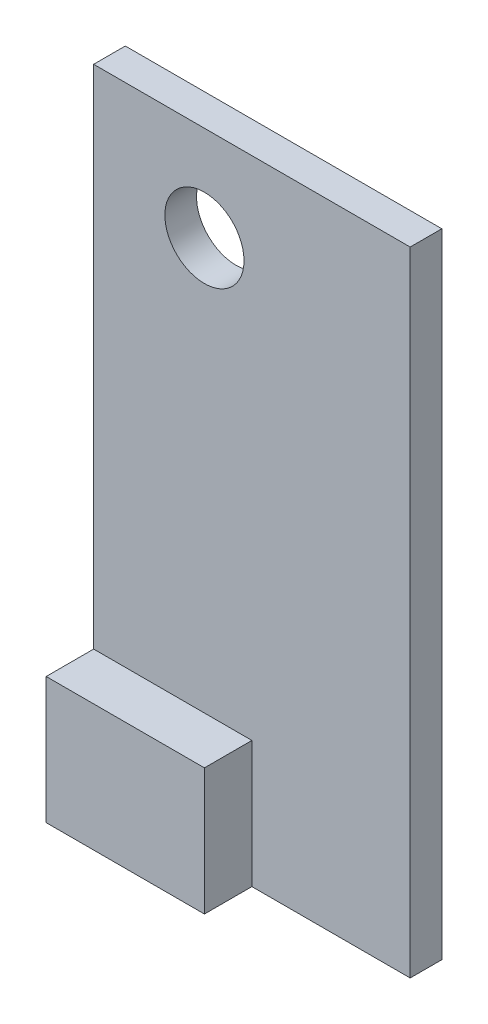
ISO-10303-21;
HEADER;
FILE_DESCRIPTION(('STEP AP214'),'2;1');
FILE_NAME('part.step','',(''),(''),'','','');
FILE_SCHEMA(('AUTOMOTIVE_DESIGN { 1 0 10303 214 1 1 1 1 }'));
ENDSEC;
DATA;
#1=APPLICATION_CONTEXT('core data for automotive mechanical design processes');
#2=APPLICATION_PROTOCOL_DEFINITION('international standard','automotive_design',2000,#1);
#3=PRODUCT_CONTEXT('',#1,'mechanical');
#4=PRODUCT('Part','Part','',(#3));
#5=PRODUCT_RELATED_PRODUCT_CATEGORY('part','',(#4));
#6=PRODUCT_DEFINITION_FORMATION('','',#4);
#7=PRODUCT_DEFINITION_CONTEXT('part definition',#1,'design');
#8=PRODUCT_DEFINITION('design','',#6,#7);
#9=PRODUCT_DEFINITION_SHAPE('','',#8);
#10=(LENGTH_UNIT() NAMED_UNIT(*) SI_UNIT(.MILLI.,.METRE.));
#11=(NAMED_UNIT(*) PLANE_ANGLE_UNIT() SI_UNIT($,.RADIAN.));
#12=(NAMED_UNIT(*) SI_UNIT($,.STERADIAN.) SOLID_ANGLE_UNIT());
#13=UNCERTAINTY_MEASURE_WITH_UNIT(LENGTH_MEASURE(1.E-05),#10,'distance_accuracy_value','');
#14=(GEOMETRIC_REPRESENTATION_CONTEXT(3) GLOBAL_UNCERTAINTY_ASSIGNED_CONTEXT((#13)) GLOBAL_UNIT_ASSIGNED_CONTEXT((#10,
#11,#12)) REPRESENTATION_CONTEXT('',''));
#15=CARTESIAN_POINT('',(0.,0.,0.));
#16=DIRECTION('',(0.,0.,1.));
#17=DIRECTION('',(1.,0.,0.));
#18=AXIS2_PLACEMENT_3D('',#15,#16,#17);
#19=CARTESIAN_POINT('',(0.,0.,10.));
#20=DIRECTION('',(0.,0.,1.));
#21=DIRECTION('',(1.,0.,0.));
#22=AXIS2_PLACEMENT_3D('',#19,#20,#21);
#23=PLANE('',#22);
#24=CARTESIAN_POINT('',(35.,170.,10.));
#25=DIRECTION('',(0.,0.,1.));
#26=DIRECTION('',(1.,0.,0.));
#27=AXIS2_PLACEMENT_3D('',#24,#25,#26);
#28=CIRCLE('',#27,12.5);
#29=CARTESIAN_POINT('',(47.5,170.,10.));
#30=VERTEX_POINT('',#29);
#31=EDGE_CURVE('E120',#30,#30,#28,.T.);
#32=ORIENTED_EDGE('',*,*,#31,.F.);
#33=EDGE_LOOP('',(#32));
#34=FACE_BOUND('',#33,.T.);
#35=DIRECTION('',(0.,-1.,0.));
#36=VECTOR('',#35,1.);
#37=CARTESIAN_POINT('',(0.,200.,10.));
#38=LINE('',#37,#36);
#39=CARTESIAN_POINT('',(0.,200.,10.));
#40=VERTEX_POINT('',#39);
#41=CARTESIAN_POINT('',(0.,40.,10.));
#42=VERTEX_POINT('',#41);
#43=EDGE_CURVE('E134',#40,#42,#38,.T.);
#44=ORIENTED_EDGE('',*,*,#43,.T.);
#45=DIRECTION('',(1.,0.,0.));
#46=VECTOR('',#45,1.);
#47=CARTESIAN_POINT('',(0.,40.,10.));
#48=LINE('',#47,#46);
#49=CARTESIAN_POINT('',(50.,40.,10.));
#50=VERTEX_POINT('',#49);
#51=EDGE_CURVE('E124',#42,#50,#48,.T.);
#52=ORIENTED_EDGE('',*,*,#51,.T.);
#53=DIRECTION('',(0.,-1.,0.));
#54=VECTOR('',#53,1.);
#55=CARTESIAN_POINT('',(50.,0.,10.));
#56=LINE('',#55,#54);
#57=CARTESIAN_POINT('',(50.,0.,10.));
#58=VERTEX_POINT('',#57);
#59=EDGE_CURVE('E125',#50,#58,#56,.T.);
#60=ORIENTED_EDGE('',*,*,#59,.T.);
#61=DIRECTION('',(1.,0.,0.));
#62=VECTOR('',#61,1.);
#63=CARTESIAN_POINT('',(0.,0.,10.));
#64=LINE('',#63,#62);
#65=CARTESIAN_POINT('',(100.,0.,10.));
#66=VERTEX_POINT('',#65);
#67=EDGE_CURVE('E83',#58,#66,#64,.T.);
#68=ORIENTED_EDGE('',*,*,#67,.T.);
#69=DIRECTION('',(0.,1.,0.));
#70=VECTOR('',#69,1.);
#71=CARTESIAN_POINT('',(100.,0.,10.));
#72=LINE('',#71,#70);
#73=CARTESIAN_POINT('',(100.,200.,10.));
#74=VERTEX_POINT('',#73);
#75=EDGE_CURVE('E137',#66,#74,#72,.T.);
#76=ORIENTED_EDGE('',*,*,#75,.T.);
#77=DIRECTION('',(-1.,0.,0.));
#78=VECTOR('',#77,1.);
#79=CARTESIAN_POINT('',(100.,200.,10.));
#80=LINE('',#79,#78);
#81=EDGE_CURVE('E59',#74,#40,#80,.T.);
#82=ORIENTED_EDGE('',*,*,#81,.T.);
#83=EDGE_LOOP('',(#44,#52,#60,#68,#76,#82));
#84=FACE_BOUND('',#83,.T.);
#85=ADVANCED_FACE('F35',(#34,#84),#23,.T.);
#86=CARTESIAN_POINT('',(0.,200.,10.));
#87=DIRECTION('',(1.,0.,0.));
#88=DIRECTION('',(0.,0.,-1.));
#89=AXIS2_PLACEMENT_3D('',#86,#87,#88);
#90=PLANE('',#89);
#91=DIRECTION('',(0.,0.,-1.));
#92=VECTOR('',#91,1.);
#93=CARTESIAN_POINT('',(0.,0.,10.));
#94=LINE('',#93,#92);
#95=CARTESIAN_POINT('',(0.,0.,25.));
#96=VERTEX_POINT('',#95);
#97=CARTESIAN_POINT('',(0.,0.,0.));
#98=VERTEX_POINT('',#97);
#99=EDGE_CURVE('E11',#96,#98,#94,.T.);
#100=ORIENTED_EDGE('',*,*,#99,.F.);
#101=DIRECTION('',(0.,-1.,0.));
#102=VECTOR('',#101,1.);
#103=CARTESIAN_POINT('',(0.,40.,25.));
#104=LINE('',#103,#102);
#105=CARTESIAN_POINT('',(0.,40.,25.));
#106=VERTEX_POINT('',#105);
#107=EDGE_CURVE('E104',#106,#96,#104,.T.);
#108=ORIENTED_EDGE('',*,*,#107,.F.);
#109=DIRECTION('',(0.,0.,-1.));
#110=VECTOR('',#109,1.);
#111=CARTESIAN_POINT('',(0.,40.,25.));
#112=LINE('',#111,#110);
#113=EDGE_CURVE('E108',#106,#42,#112,.T.);
#114=ORIENTED_EDGE('',*,*,#113,.T.);
#115=ORIENTED_EDGE('',*,*,#43,.F.);
#116=DIRECTION('',(0.,0.,-1.));
#117=VECTOR('',#116,1.);
#118=CARTESIAN_POINT('',(0.,200.,10.));
#119=LINE('',#118,#117);
#120=CARTESIAN_POINT('',(0.,200.,0.));
#121=VERTEX_POINT('',#120);
#122=EDGE_CURVE('E140',#40,#121,#119,.T.);
#123=ORIENTED_EDGE('',*,*,#122,.T.);
#124=DIRECTION('',(0.,-1.,0.));
#125=VECTOR('',#124,1.);
#126=CARTESIAN_POINT('',(0.,200.,0.));
#127=LINE('',#126,#125);
#128=EDGE_CURVE('E133',#121,#98,#127,.T.);
#129=ORIENTED_EDGE('',*,*,#128,.T.);
#130=EDGE_LOOP('',(#100,#108,#114,#115,#123,#129));
#131=FACE_BOUND('',#130,.T.);
#132=ADVANCED_FACE('F37',(#131),#90,.F.);
#133=CARTESIAN_POINT('',(0.,0.,10.));
#134=DIRECTION('',(0.,1.,0.));
#135=DIRECTION('',(0.,0.,1.));
#136=AXIS2_PLACEMENT_3D('',#133,#134,#135);
#137=PLANE('',#136);
#138=DIRECTION('',(1.,0.,0.));
#139=VECTOR('',#138,1.);
#140=CARTESIAN_POINT('',(0.,0.,0.));
#141=LINE('',#140,#139);
#142=CARTESIAN_POINT('',(100.,0.,0.));
#143=VERTEX_POINT('',#142);
#144=EDGE_CURVE('E142',#98,#143,#141,.T.);
#145=ORIENTED_EDGE('',*,*,#144,.T.);
#146=DIRECTION('',(0.,0.,-1.));
#147=VECTOR('',#146,1.);
#148=CARTESIAN_POINT('',(100.,0.,10.));
#149=LINE('',#148,#147);
#150=EDGE_CURVE('E43',#66,#143,#149,.T.);
#151=ORIENTED_EDGE('',*,*,#150,.F.);
#152=ORIENTED_EDGE('',*,*,#67,.F.);
#153=DIRECTION('',(0.,0.,-1.));
#154=VECTOR('',#153,1.);
#155=CARTESIAN_POINT('',(50.,0.,25.));
#156=LINE('',#155,#154);
#157=CARTESIAN_POINT('',(50.,0.,25.));
#158=VERTEX_POINT('',#157);
#159=EDGE_CURVE('E50',#158,#58,#156,.T.);
#160=ORIENTED_EDGE('',*,*,#159,.F.);
#161=DIRECTION('',(1.,0.,0.));
#162=VECTOR('',#161,1.);
#163=CARTESIAN_POINT('',(0.,0.,25.));
#164=LINE('',#163,#162);
#165=EDGE_CURVE('E111',#96,#158,#164,.T.);
#166=ORIENTED_EDGE('',*,*,#165,.F.);
#167=ORIENTED_EDGE('',*,*,#99,.T.);
#168=EDGE_LOOP('',(#145,#151,#152,#160,#166,#167));
#169=FACE_BOUND('',#168,.T.);
#170=ADVANCED_FACE('F169',(#169),#137,.F.);
#171=CARTESIAN_POINT('',(100.,0.,10.));
#172=DIRECTION('',(-1.,0.,0.));
#173=DIRECTION('',(0.,0.,1.));
#174=AXIS2_PLACEMENT_3D('',#171,#172,#173);
#175=PLANE('',#174);
#176=DIRECTION('',(0.,1.,0.));
#177=VECTOR('',#176,1.);
#178=CARTESIAN_POINT('',(100.,0.,0.));
#179=LINE('',#178,#177);
#180=CARTESIAN_POINT('',(100.,200.,0.));
#181=VERTEX_POINT('',#180);
#182=EDGE_CURVE('E144',#143,#181,#179,.T.);
#183=ORIENTED_EDGE('',*,*,#182,.T.);
#184=DIRECTION('',(0.,0.,-1.));
#185=VECTOR('',#184,1.);
#186=CARTESIAN_POINT('',(100.,200.,10.));
#187=LINE('',#186,#185);
#188=EDGE_CURVE('E148',#74,#181,#187,.T.);
#189=ORIENTED_EDGE('',*,*,#188,.F.);
#190=ORIENTED_EDGE('',*,*,#75,.F.);
#191=ORIENTED_EDGE('',*,*,#150,.T.);
#192=EDGE_LOOP('',(#183,#189,#190,#191));
#193=FACE_BOUND('',#192,.T.);
#194=ADVANCED_FACE('F153',(#193),#175,.F.);
#195=CARTESIAN_POINT('',(100.,200.,10.));
#196=DIRECTION('',(0.,-1.,0.));
#197=DIRECTION('',(1.,0.,0.));
#198=AXIS2_PLACEMENT_3D('',#195,#196,#197);
#199=PLANE('',#198);
#200=DIRECTION('',(-1.,0.,0.));
#201=VECTOR('',#200,1.);
#202=CARTESIAN_POINT('',(100.,200.,0.));
#203=LINE('',#202,#201);
#204=EDGE_CURVE('E79',#181,#121,#203,.T.);
#205=ORIENTED_EDGE('',*,*,#204,.T.);
#206=ORIENTED_EDGE('',*,*,#122,.F.);
#207=ORIENTED_EDGE('',*,*,#81,.F.);
#208=ORIENTED_EDGE('',*,*,#188,.T.);
#209=EDGE_LOOP('',(#205,#206,#207,#208));
#210=FACE_BOUND('',#209,.T.);
#211=ADVANCED_FACE('F160',(#210),#199,.F.);
#212=CARTESIAN_POINT('',(0.,0.,0.));
#213=DIRECTION('',(0.,0.,1.));
#214=DIRECTION('',(1.,0.,0.));
#215=AXIS2_PLACEMENT_3D('',#212,#213,#214);
#216=PLANE('',#215);
#217=CARTESIAN_POINT('',(35.,170.,0.));
#218=DIRECTION('',(0.,0.,1.));
#219=DIRECTION('',(1.,0.,0.));
#220=AXIS2_PLACEMENT_3D('',#217,#218,#219);
#221=CIRCLE('',#220,12.5);
#222=CARTESIAN_POINT('',(47.5,170.,0.));
#223=VERTEX_POINT('',#222);
#224=EDGE_CURVE('E195',#223,#223,#221,.T.);
#225=ORIENTED_EDGE('',*,*,#224,.T.);
#226=EDGE_LOOP('',(#225));
#227=FACE_BOUND('',#226,.T.);
#228=ORIENTED_EDGE('',*,*,#144,.F.);
#229=ORIENTED_EDGE('',*,*,#128,.F.);
#230=ORIENTED_EDGE('',*,*,#204,.F.);
#231=ORIENTED_EDGE('',*,*,#182,.F.);
#232=EDGE_LOOP('',(#228,#229,#230,#231));
#233=FACE_BOUND('',#232,.T.);
#234=ADVANCED_FACE('F158',(#227,#233),#216,.F.);
#235=CARTESIAN_POINT('',(50.,40.,25.));
#236=DIRECTION('',(0.,-1.,0.));
#237=DIRECTION('',(0.,0.,-1.));
#238=AXIS2_PLACEMENT_3D('',#235,#236,#237);
#239=PLANE('',#238);
#240=ORIENTED_EDGE('',*,*,#51,.F.);
#241=ORIENTED_EDGE('',*,*,#113,.F.);
#242=DIRECTION('',(-1.,0.,0.));
#243=VECTOR('',#242,1.);
#244=CARTESIAN_POINT('',(50.,40.,25.));
#245=LINE('',#244,#243);
#246=CARTESIAN_POINT('',(50.,40.,25.));
#247=VERTEX_POINT('',#246);
#248=EDGE_CURVE('E112',#247,#106,#245,.T.);
#249=ORIENTED_EDGE('',*,*,#248,.F.);
#250=DIRECTION('',(0.,0.,-1.));
#251=VECTOR('',#250,1.);
#252=CARTESIAN_POINT('',(50.,40.,25.));
#253=LINE('',#252,#251);
#254=EDGE_CURVE('E128',#247,#50,#253,.T.);
#255=ORIENTED_EDGE('',*,*,#254,.T.);
#256=EDGE_LOOP('',(#240,#241,#249,#255));
#257=FACE_BOUND('',#256,.T.);
#258=ADVANCED_FACE('F122',(#257),#239,.F.);
#259=CARTESIAN_POINT('',(50.,0.,25.));
#260=DIRECTION('',(-1.,0.,0.));
#261=DIRECTION('',(0.,-1.,0.));
#262=AXIS2_PLACEMENT_3D('',#259,#260,#261);
#263=PLANE('',#262);
#264=ORIENTED_EDGE('',*,*,#59,.F.);
#265=ORIENTED_EDGE('',*,*,#254,.F.);
#266=DIRECTION('',(0.,1.,0.));
#267=VECTOR('',#266,1.);
#268=CARTESIAN_POINT('',(50.,0.,25.));
#269=LINE('',#268,#267);
#270=EDGE_CURVE('E116',#158,#247,#269,.T.);
#271=ORIENTED_EDGE('',*,*,#270,.F.);
#272=ORIENTED_EDGE('',*,*,#159,.T.);
#273=EDGE_LOOP('',(#264,#265,#271,#272));
#274=FACE_BOUND('',#273,.T.);
#275=ADVANCED_FACE('F181',(#274),#263,.F.);
#276=CARTESIAN_POINT('',(0.,0.,25.));
#277=DIRECTION('',(0.,0.,1.));
#278=DIRECTION('',(1.,0.,0.));
#279=AXIS2_PLACEMENT_3D('',#276,#277,#278);
#280=PLANE('',#279);
#281=ORIENTED_EDGE('',*,*,#248,.T.);
#282=ORIENTED_EDGE('',*,*,#107,.T.);
#283=ORIENTED_EDGE('',*,*,#165,.T.);
#284=ORIENTED_EDGE('',*,*,#270,.T.);
#285=EDGE_LOOP('',(#281,#282,#283,#284));
#286=FACE_BOUND('',#285,.T.);
#287=ADVANCED_FACE('F115',(#286),#280,.T.);
#288=CARTESIAN_POINT('',(35.,170.,0.));
#289=DIRECTION('',(0.,0.,1.));
#290=DIRECTION('',(1.,0.,0.));
#291=AXIS2_PLACEMENT_3D('',#288,#289,#290);
#292=CYLINDRICAL_SURFACE('',#291,12.5);
#293=ORIENTED_EDGE('',*,*,#31,.T.);
#294=EDGE_LOOP('',(#293));
#295=FACE_BOUND('',#294,.T.);
#296=ORIENTED_EDGE('',*,*,#224,.F.);
#297=EDGE_LOOP('',(#296));
#298=FACE_BOUND('',#297,.T.);
#299=ADVANCED_FACE('F186',(#295,#298),#292,.F.);
#300=CLOSED_SHELL('',(#85,#132,#170,#194,#211,#234,#258,#275,#287,#299));
#301=MANIFOLD_SOLID_BREP('B2',#300);
#302=ADVANCED_BREP_SHAPE_REPRESENTATION('',(#18,#301),#14);
#303=SHAPE_DEFINITION_REPRESENTATION(#9,#302);
ENDSEC;
END-ISO-10303-21;
